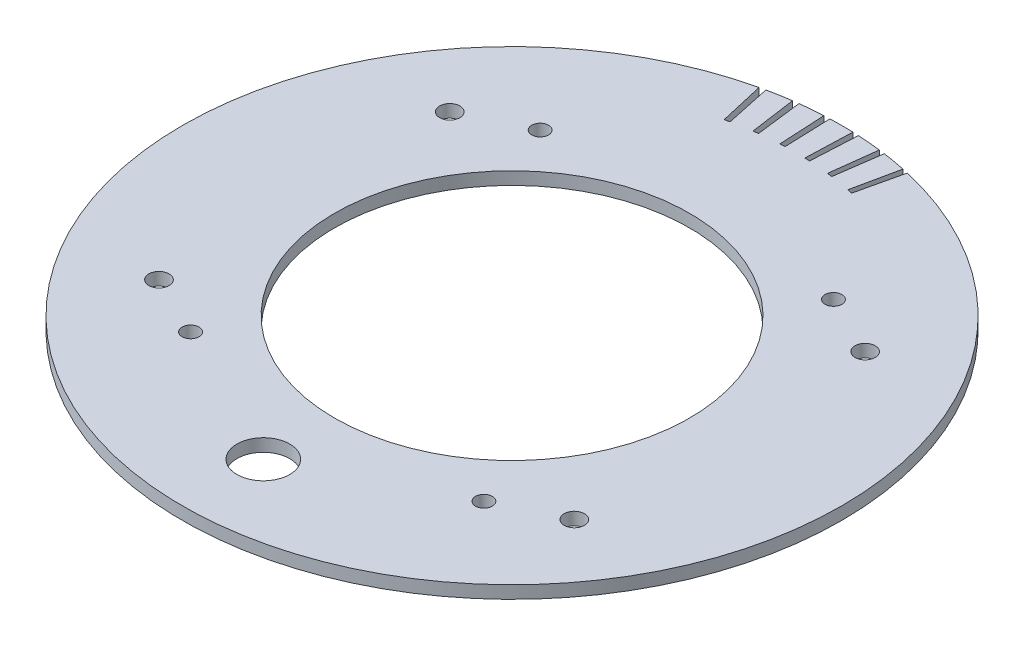
ISO-10303-21;
HEADER;
FILE_DESCRIPTION(('STEP AP214'),'2;1');
FILE_NAME('part.step','',(''),(''),'','','');
FILE_SCHEMA(('AUTOMOTIVE_DESIGN { 1 0 10303 214 1 1 1 1 }'));
ENDSEC;
DATA;
#1=APPLICATION_CONTEXT('core data for automotive mechanical design processes');
#2=APPLICATION_PROTOCOL_DEFINITION('international standard','automotive_design',2000,#1);
#3=PRODUCT_CONTEXT('',#1,'mechanical');
#4=PRODUCT('Part','Part','',(#3));
#5=PRODUCT_RELATED_PRODUCT_CATEGORY('part','',(#4));
#6=PRODUCT_DEFINITION_FORMATION('','',#4);
#7=PRODUCT_DEFINITION_CONTEXT('part definition',#1,'design');
#8=PRODUCT_DEFINITION('design','',#6,#7);
#9=PRODUCT_DEFINITION_SHAPE('','',#8);
#10=(LENGTH_UNIT() NAMED_UNIT(*) SI_UNIT(.MILLI.,.METRE.));
#11=(NAMED_UNIT(*) PLANE_ANGLE_UNIT() SI_UNIT($,.RADIAN.));
#12=(NAMED_UNIT(*) SI_UNIT($,.STERADIAN.) SOLID_ANGLE_UNIT());
#13=UNCERTAINTY_MEASURE_WITH_UNIT(LENGTH_MEASURE(1.E-05),#10,'distance_accuracy_value','');
#14=(GEOMETRIC_REPRESENTATION_CONTEXT(3) GLOBAL_UNCERTAINTY_ASSIGNED_CONTEXT((#13)) GLOBAL_UNIT_ASSIGNED_CONTEXT((#10,
#11,#12)) REPRESENTATION_CONTEXT('',''));
#15=CARTESIAN_POINT('',(0.,0.,0.));
#16=DIRECTION('',(0.,0.,1.));
#17=DIRECTION('',(1.,0.,0.));
#18=AXIS2_PLACEMENT_3D('',#15,#16,#17);
#19=CARTESIAN_POINT('',(0.,-1.905,0.));
#20=DIRECTION('',(0.,1.,0.));
#21=DIRECTION('',(0.,0.,1.));
#22=AXIS2_PLACEMENT_3D('',#19,#20,#21);
#23=CYLINDRICAL_SURFACE('',#22,99.06);
#24=CARTESIAN_POINT('',(0.,1.905,0.));
#25=DIRECTION('',(0.,1.,0.));
#26=DIRECTION('',(0.,0.,1.));
#27=AXIS2_PLACEMENT_3D('',#24,#25,#26);
#28=CIRCLE('',#27,99.06);
#29=CARTESIAN_POINT('',(-13.7864873811041,1.905,-98.09595488954));
#30=VERTEX_POINT('',#29);
#31=CARTESIAN_POINT('',(-20.5957320924073,1.905,-96.8953013286908));
#32=VERTEX_POINT('',#31);
#33=EDGE_CURVE('E360',#30,#32,#28,.T.);
#34=ORIENTED_EDGE('',*,*,#33,.F.);
#35=DIRECTION('',(0.,1.,0.));
#36=VECTOR('',#35,1.);
#37=CARTESIAN_POINT('',(-13.7864873811041,-1.905,-98.09595488954));
#38=LINE('',#37,#36);
#39=CARTESIAN_POINT('',(-13.7864873811041,-1.905,-98.09595488954));
#40=VERTEX_POINT('',#39);
#41=EDGE_CURVE('E239',#40,#30,#38,.T.);
#42=ORIENTED_EDGE('',*,*,#41,.F.);
#43=CARTESIAN_POINT('',(0.,-1.905,0.));
#44=DIRECTION('',(0.,1.,0.));
#45=DIRECTION('',(0.,0.,1.));
#46=AXIS2_PLACEMENT_3D('',#43,#44,#45);
#47=CIRCLE('',#46,99.06);
#48=CARTESIAN_POINT('',(-20.5957320924073,-1.905,-96.8953013286908));
#49=VERTEX_POINT('',#48);
#50=EDGE_CURVE('E374',#40,#49,#47,.T.);
#51=ORIENTED_EDGE('',*,*,#50,.T.);
#52=DIRECTION('',(0.,1.,0.));
#53=VECTOR('',#52,1.);
#54=CARTESIAN_POINT('',(-20.5957320924073,-1.905,-96.8953013286908));
#55=LINE('',#54,#53);
#56=EDGE_CURVE('E363',#49,#32,#55,.T.);
#57=ORIENTED_EDGE('',*,*,#56,.T.);
#58=EDGE_LOOP('',(#34,#42,#51,#57));
#59=FACE_BOUND('',#58,.T.);
#60=ADVANCED_FACE('F41',(#59),#23,.T.);
#61=DIRECTION('',(0.,1.,0.));
#62=VECTOR('',#61,1.);
#63=CARTESIAN_POINT('',(-12.0723771577139,-1.905,-98.3216217815893));
#64=LINE('',#63,#62);
#65=CARTESIAN_POINT('',(-12.0723771577139,-1.905,-98.3216217815893));
#66=VERTEX_POINT('',#65);
#67=CARTESIAN_POINT('',(-12.0723771577139,1.905,-98.3216217815893));
#68=VERTEX_POINT('',#67);
#69=EDGE_CURVE('E209',#66,#68,#64,.T.);
#70=ORIENTED_EDGE('',*,*,#69,.T.);
#71=CARTESIAN_POINT('',(-5.18439982542604,1.905,-98.9242417127881));
#72=VERTEX_POINT('',#71);
#73=EDGE_CURVE('E414',#72,#68,#28,.T.);
#74=ORIENTED_EDGE('',*,*,#73,.F.);
#75=DIRECTION('',(0.,1.,0.));
#76=VECTOR('',#75,1.);
#77=CARTESIAN_POINT('',(-5.18439982542604,-1.905,-98.9242417127881));
#78=LINE('',#77,#76);
#79=CARTESIAN_POINT('',(-5.18439982542604,-1.905,-98.9242417127881));
#80=VERTEX_POINT('',#79);
#81=EDGE_CURVE('E258',#80,#72,#78,.T.);
#82=ORIENTED_EDGE('',*,*,#81,.F.);
#83=EDGE_CURVE('E382',#80,#66,#47,.T.);
#84=ORIENTED_EDGE('',*,*,#83,.T.);
#85=EDGE_LOOP('',(#70,#74,#82,#84));
#86=FACE_BOUND('',#85,.T.);
#87=ADVANCED_FACE('F425',(#86),#23,.T.);
#88=DIRECTION('',(0.,1.,0.));
#89=VECTOR('',#88,1.);
#90=CARTESIAN_POINT('',(-3.45714414334976,-1.905,-98.9996553245116));
#91=LINE('',#90,#89);
#92=CARTESIAN_POINT('',(-3.45714414334976,-1.905,-98.9996553245116));
#93=VERTEX_POINT('',#92);
#94=CARTESIAN_POINT('',(-3.45714414334976,1.905,-98.9996553245116));
#95=VERTEX_POINT('',#94);
#96=EDGE_CURVE('E260',#93,#95,#91,.T.);
#97=ORIENTED_EDGE('',*,*,#96,.T.);
#98=CARTESIAN_POINT('',(3.45714414334975,1.905,-98.9996553245116));
#99=VERTEX_POINT('',#98);
#100=EDGE_CURVE('E411',#99,#95,#28,.T.);
#101=ORIENTED_EDGE('',*,*,#100,.F.);
#102=DIRECTION('',(0.,1.,0.));
#103=VECTOR('',#102,1.);
#104=CARTESIAN_POINT('',(3.45714414334975,-1.905,-98.9996553245116));
#105=LINE('',#104,#103);
#106=CARTESIAN_POINT('',(3.45714414334975,-1.905,-98.9996553245116));
#107=VERTEX_POINT('',#106);
#108=EDGE_CURVE('E283',#107,#99,#105,.T.);
#109=ORIENTED_EDGE('',*,*,#108,.F.);
#110=EDGE_CURVE('E386',#107,#93,#47,.T.);
#111=ORIENTED_EDGE('',*,*,#110,.T.);
#112=EDGE_LOOP('',(#97,#101,#109,#111));
#113=FACE_BOUND('',#112,.T.);
#114=ADVANCED_FACE('F429',(#113),#23,.T.);
#115=DIRECTION('',(0.,1.,0.));
#116=VECTOR('',#115,1.);
#117=CARTESIAN_POINT('',(5.18439982542603,-1.905,-98.9242417127881));
#118=LINE('',#117,#116);
#119=CARTESIAN_POINT('',(5.18439982542603,-1.905,-98.9242417127881));
#120=VERTEX_POINT('',#119);
#121=CARTESIAN_POINT('',(5.18439982542603,1.905,-98.9242417127881));
#122=VERTEX_POINT('',#121);
#123=EDGE_CURVE('E285',#120,#122,#118,.T.);
#124=ORIENTED_EDGE('',*,*,#123,.T.);
#125=CARTESIAN_POINT('',(12.0723771577139,1.905,-98.3216217815893));
#126=VERTEX_POINT('',#125);
#127=EDGE_CURVE('E410',#126,#122,#28,.T.);
#128=ORIENTED_EDGE('',*,*,#127,.F.);
#129=DIRECTION('',(0.,1.,0.));
#130=VECTOR('',#129,1.);
#131=CARTESIAN_POINT('',(12.0723771577139,-1.905,-98.3216217815893));
#132=LINE('',#131,#130);
#133=CARTESIAN_POINT('',(12.0723771577139,-1.905,-98.3216217815893));
#134=VERTEX_POINT('',#133);
#135=EDGE_CURVE('E309',#134,#126,#132,.T.);
#136=ORIENTED_EDGE('',*,*,#135,.F.);
#137=EDGE_CURVE('E381',#134,#120,#47,.T.);
#138=ORIENTED_EDGE('',*,*,#137,.T.);
#139=EDGE_LOOP('',(#124,#128,#136,#138));
#140=FACE_BOUND('',#139,.T.);
#141=ADVANCED_FACE('F397',(#140),#23,.T.);
#142=DIRECTION('',(0.,1.,0.));
#143=VECTOR('',#142,1.);
#144=CARTESIAN_POINT('',(13.7864873811041,-1.905,-98.0959548895399));
#145=LINE('',#144,#143);
#146=CARTESIAN_POINT('',(13.7864873811041,-1.905,-98.0959548895399));
#147=VERTEX_POINT('',#146);
#148=CARTESIAN_POINT('',(13.7864873811041,1.905,-98.0959548895399));
#149=VERTEX_POINT('',#148);
#150=EDGE_CURVE('E311',#147,#149,#145,.T.);
#151=ORIENTED_EDGE('',*,*,#150,.T.);
#152=CARTESIAN_POINT('',(20.5957320924073,1.905,-96.8953013286908));
#153=VERTEX_POINT('',#152);
#154=EDGE_CURVE('E372',#153,#149,#28,.T.);
#155=ORIENTED_EDGE('',*,*,#154,.F.);
#156=DIRECTION('',(0.,1.,0.));
#157=VECTOR('',#156,1.);
#158=CARTESIAN_POINT('',(20.5957320924073,-1.905,-96.8953013286908));
#159=LINE('',#158,#157);
#160=CARTESIAN_POINT('',(20.5957320924073,-1.905,-96.8953013286908));
#161=VERTEX_POINT('',#160);
#162=EDGE_CURVE('E334',#161,#153,#159,.T.);
#163=ORIENTED_EDGE('',*,*,#162,.F.);
#164=EDGE_CURVE('E376',#161,#147,#47,.T.);
#165=ORIENTED_EDGE('',*,*,#164,.T.);
#166=EDGE_LOOP('',(#151,#155,#163,#165));
#167=FACE_BOUND('',#166,.T.);
#168=ADVANCED_FACE('F432',(#167),#23,.T.);
#169=CARTESIAN_POINT('',(0.,-1.905,0.));
#170=DIRECTION('',(0.,1.,0.));
#171=DIRECTION('',(0.,0.,1.));
#172=AXIS2_PLACEMENT_3D('',#169,#170,#171);
#173=PLANE('',#172);
#174=CARTESIAN_POINT('',(-44.082374272303,-1.905,52.5353279090994));
#175=DIRECTION('',(0.,-1.,0.));
#176=DIRECTION('',(0.,0.,-1.));
#177=AXIS2_PLACEMENT_3D('',#174,#175,#176);
#178=CIRCLE('',#177,2.54000000000001);
#179=CARTESIAN_POINT('',(-44.082374272303,-1.905,49.9953279090994));
#180=VERTEX_POINT('',#179);
#181=EDGE_CURVE('E734',#180,#180,#178,.T.);
#182=ORIENTED_EDGE('',*,*,#181,.F.);
#183=EDGE_LOOP('',(#182));
#184=FACE_BOUND('',#183,.T.);
#185=CARTESIAN_POINT('',(44.082374272303,-1.905,52.5353279090994));
#186=DIRECTION('',(0.,-1.,0.));
#187=DIRECTION('',(0.,0.,-1.));
#188=AXIS2_PLACEMENT_3D('',#185,#186,#187);
#189=CIRCLE('',#188,2.54000000000001);
#190=CARTESIAN_POINT('',(44.082374272303,-1.905,49.9953279090994));
#191=VERTEX_POINT('',#190);
#192=EDGE_CURVE('E745',#191,#191,#189,.T.);
#193=ORIENTED_EDGE('',*,*,#192,.F.);
#194=EDGE_LOOP('',(#193));
#195=FACE_BOUND('',#194,.T.);
#196=CARTESIAN_POINT('',(62.4193857748213,-1.905,43.7065244499496));
#197=DIRECTION('',(0.,-1.,0.));
#198=DIRECTION('',(0.,0.,-1.));
#199=AXIS2_PLACEMENT_3D('',#196,#197,#198);
#200=CIRCLE('',#199,3.04800000000002);
#201=CARTESIAN_POINT('',(62.4193857748213,-1.905,40.6585244499496));
#202=VERTEX_POINT('',#201);
#203=EDGE_CURVE('E751',#202,#202,#200,.T.);
#204=ORIENTED_EDGE('',*,*,#203,.F.);
#205=EDGE_LOOP('',(#204));
#206=FACE_BOUND('',#205,.T.);
#207=CARTESIAN_POINT('',(62.4193857748213,-1.905,-43.7065244499496));
#208=DIRECTION('',(0.,-1.,0.));
#209=DIRECTION('',(0.,0.,-1.));
#210=AXIS2_PLACEMENT_3D('',#207,#208,#209);
#211=CIRCLE('',#210,3.04800000000002);
#212=CARTESIAN_POINT('',(62.4193857748213,-1.905,-46.7545244499496));
#213=VERTEX_POINT('',#212);
#214=EDGE_CURVE('E757',#213,#213,#211,.T.);
#215=ORIENTED_EDGE('',*,*,#214,.F.);
#216=EDGE_LOOP('',(#215));
#217=FACE_BOUND('',#216,.T.);
#218=CARTESIAN_POINT('',(44.082374272303,-1.905,-52.5353279090994));
#219=DIRECTION('',(0.,-1.,0.));
#220=DIRECTION('',(0.,0.,-1.));
#221=AXIS2_PLACEMENT_3D('',#218,#219,#220);
#222=CIRCLE('',#221,2.54);
#223=CARTESIAN_POINT('',(44.082374272303,-1.905,-55.0753279090994));
#224=VERTEX_POINT('',#223);
#225=EDGE_CURVE('E798',#224,#224,#222,.T.);
#226=ORIENTED_EDGE('',*,*,#225,.F.);
#227=EDGE_LOOP('',(#226));
#228=FACE_BOUND('',#227,.T.);
#229=CARTESIAN_POINT('',(-44.082374272303,-1.905,-52.5353279090994));
#230=DIRECTION('',(0.,-1.,0.));
#231=DIRECTION('',(0.,0.,-1.));
#232=AXIS2_PLACEMENT_3D('',#229,#230,#231);
#233=CIRCLE('',#232,2.54);
#234=CARTESIAN_POINT('',(-44.082374272303,-1.905,-55.0753279090994));
#235=VERTEX_POINT('',#234);
#236=EDGE_CURVE('E795',#235,#235,#233,.T.);
#237=ORIENTED_EDGE('',*,*,#236,.F.);
#238=EDGE_LOOP('',(#237));
#239=FACE_BOUND('',#238,.T.);
#240=CARTESIAN_POINT('',(-62.4193857748213,-1.905,-43.7065244499496));
#241=DIRECTION('',(0.,-1.,0.));
#242=DIRECTION('',(0.,0.,-1.));
#243=AXIS2_PLACEMENT_3D('',#240,#241,#242);
#244=CIRCLE('',#243,3.04800000000002);
#245=CARTESIAN_POINT('',(-62.4193857748213,-1.905,-46.7545244499496));
#246=VERTEX_POINT('',#245);
#247=EDGE_CURVE('E788',#246,#246,#244,.T.);
#248=ORIENTED_EDGE('',*,*,#247,.F.);
#249=EDGE_LOOP('',(#248));
#250=FACE_BOUND('',#249,.T.);
#251=CARTESIAN_POINT('',(0.,-1.905,74.75474));
#252=DIRECTION('',(0.,-1.,0.));
#253=DIRECTION('',(0.,0.,-1.));
#254=AXIS2_PLACEMENT_3D('',#251,#252,#253);
#255=CIRCLE('',#254,7.9375);
#256=CARTESIAN_POINT('',(0.,-1.905,66.81724));
#257=VERTEX_POINT('',#256);
#258=EDGE_CURVE('E789',#257,#257,#255,.T.);
#259=ORIENTED_EDGE('',*,*,#258,.F.);
#260=EDGE_LOOP('',(#259));
#261=FACE_BOUND('',#260,.T.);
#262=CARTESIAN_POINT('',(-62.4193857748213,-1.905,43.7065244499496));
#263=DIRECTION('',(0.,-1.,0.));
#264=DIRECTION('',(0.,0.,-1.));
#265=AXIS2_PLACEMENT_3D('',#262,#263,#264);
#266=CIRCLE('',#265,3.048);
#267=CARTESIAN_POINT('',(-62.4193857748213,-1.905,40.6585244499496));
#268=VERTEX_POINT('',#267);
#269=EDGE_CURVE('E738',#268,#268,#266,.T.);
#270=ORIENTED_EDGE('',*,*,#269,.F.);
#271=EDGE_LOOP('',(#270));
#272=FACE_BOUND('',#271,.T.);
#273=CARTESIAN_POINT('',(0.,-1.905,0.));
#274=DIRECTION('',(0.,1.,0.));
#275=DIRECTION('',(0.,0.,1.));
#276=AXIS2_PLACEMENT_3D('',#273,#274,#275);
#277=CIRCLE('',#276,53.34);
#278=CARTESIAN_POINT('',(0.,-1.905,53.34));
#279=VERTEX_POINT('',#278);
#280=EDGE_CURVE('E11',#279,#279,#277,.T.);
#281=ORIENTED_EDGE('',*,*,#280,.T.);
#282=EDGE_LOOP('',(#281));
#283=FACE_BOUND('',#282,.T.);
#284=DIRECTION('',(-0.139173100960066,0.,-0.99026806874157));
#285=VECTOR('',#284,1.);
#286=CARTESIAN_POINT('',(0.,-1.905,0.));
#287=LINE('',#286,#285);
#288=CARTESIAN_POINT('',(-11.842239160692,-1.905,-84.2619099692202));
#289=VERTEX_POINT('',#288);
#290=EDGE_CURVE('E210',#289,#40,#287,.T.);
#291=ORIENTED_EDGE('',*,*,#290,.F.);
#292=CARTESIAN_POINT('',(0.,-1.905,0.));
#293=DIRECTION('',(0.,1.,0.));
#294=DIRECTION('',(-0.0871557427476584,0.,0.996194698091746));
#295=AXIS2_PLACEMENT_3D('',#292,#293,#294);
#296=CIRCLE('',#295,85.09);
#297=CARTESIAN_POINT('',(-10.369862430344,-1.905,-84.4557520431601));
#298=VERTEX_POINT('',#297);
#299=EDGE_CURVE('E205',#298,#289,#296,.T.);
#300=ORIENTED_EDGE('',*,*,#299,.F.);
#301=DIRECTION('',(-0.121869343405148,0.,-0.992546151641322));
#302=VECTOR('',#301,1.);
#303=CARTESIAN_POINT('',(0.,-1.905,0.));
#304=LINE('',#303,#302);
#305=EDGE_CURVE('E213',#298,#66,#304,.T.);
#306=ORIENTED_EDGE('',*,*,#305,.T.);
#307=ORIENTED_EDGE('',*,*,#83,.F.);
#308=DIRECTION('',(-0.0523359562429441,0.,-0.998629534754574));
#309=VECTOR('',#308,1.);
#310=CARTESIAN_POINT('',(0.,-1.905,0.));
#311=LINE('',#310,#309);
#312=CARTESIAN_POINT('',(-4.45326651671211,-1.905,-84.9733871122667));
#313=VERTEX_POINT('',#312);
#314=EDGE_CURVE('E248',#313,#80,#311,.T.);
#315=ORIENTED_EDGE('',*,*,#314,.F.);
#316=CARTESIAN_POINT('',(0.,-1.905,0.));
#317=DIRECTION('',(0.,1.,0.));
#318=DIRECTION('',(-0.173648177666931,0.,0.984807753012208));
#319=AXIS2_PLACEMENT_3D('',#316,#317,#318);
#320=CIRCLE('',#319,85.09);
#321=CARTESIAN_POINT('',(-2.96959817441582,-1.905,-85.0381654710549));
#322=VERTEX_POINT('',#321);
#323=EDGE_CURVE('E242',#322,#313,#320,.T.);
#324=ORIENTED_EDGE('',*,*,#323,.F.);
#325=DIRECTION('',(-0.0348994967025011,0.,-0.999390827019096));
#326=VECTOR('',#325,1.);
#327=CARTESIAN_POINT('',(0.,-1.905,0.));
#328=LINE('',#327,#326);
#329=EDGE_CURVE('E244',#322,#93,#328,.T.);
#330=ORIENTED_EDGE('',*,*,#329,.T.);
#331=ORIENTED_EDGE('',*,*,#110,.F.);
#332=DIRECTION('',(0.034899496702501,0.,-0.999390827019096));
#333=VECTOR('',#332,1.);
#334=CARTESIAN_POINT('',(0.,-1.905,0.));
#335=LINE('',#334,#333);
#336=CARTESIAN_POINT('',(2.96959817441581,-1.905,-85.0381654710549));
#337=VERTEX_POINT('',#336);
#338=EDGE_CURVE('E270',#337,#107,#335,.T.);
#339=ORIENTED_EDGE('',*,*,#338,.F.);
#340=CARTESIAN_POINT('',(0.,-1.905,0.));
#341=DIRECTION('',(0.,1.,0.));
#342=DIRECTION('',(-0.258819045102521,0.,0.965925826289068));
#343=AXIS2_PLACEMENT_3D('',#340,#341,#342);
#344=CIRCLE('',#343,85.09);
#345=CARTESIAN_POINT('',(4.4532665167121,-1.905,-84.9733871122667));
#346=VERTEX_POINT('',#345);
#347=EDGE_CURVE('E264',#346,#337,#344,.T.);
#348=ORIENTED_EDGE('',*,*,#347,.F.);
#349=DIRECTION('',(0.0523359562429439,0.,-0.998629534754574));
#350=VECTOR('',#349,1.);
#351=CARTESIAN_POINT('',(0.,-1.905,0.));
#352=LINE('',#351,#350);
#353=EDGE_CURVE('E266',#346,#120,#352,.T.);
#354=ORIENTED_EDGE('',*,*,#353,.T.);
#355=ORIENTED_EDGE('',*,*,#137,.F.);
#356=DIRECTION('',(0.121869343405148,0.,-0.992546151641322));
#357=VECTOR('',#356,1.);
#358=CARTESIAN_POINT('',(0.,-1.905,0.));
#359=LINE('',#358,#357);
#360=CARTESIAN_POINT('',(10.369862430344,-1.905,-84.4557520431601));
#361=VERTEX_POINT('',#360);
#362=EDGE_CURVE('E296',#361,#134,#359,.T.);
#363=ORIENTED_EDGE('',*,*,#362,.F.);
#364=CARTESIAN_POINT('',(0.,-1.905,0.));
#365=DIRECTION('',(0.,1.,0.));
#366=DIRECTION('',(-0.342020143325669,0.,0.939692620785908));
#367=AXIS2_PLACEMENT_3D('',#364,#365,#366);
#368=CIRCLE('',#367,85.09);
#369=CARTESIAN_POINT('',(11.842239160692,-1.905,-84.2619099692202));
#370=VERTEX_POINT('',#369);
#371=EDGE_CURVE('E290',#370,#361,#368,.T.);
#372=ORIENTED_EDGE('',*,*,#371,.F.);
#373=DIRECTION('',(0.139173100960066,0.,-0.99026806874157));
#374=VECTOR('',#373,1.);
#375=CARTESIAN_POINT('',(0.,-1.905,0.));
#376=LINE('',#375,#374);
#377=EDGE_CURVE('E292',#370,#147,#376,.T.);
#378=ORIENTED_EDGE('',*,*,#377,.T.);
#379=ORIENTED_EDGE('',*,*,#164,.F.);
#380=DIRECTION('',(0.20791169081776,0.,-0.978147600733806));
#381=VECTOR('',#380,1.);
#382=CARTESIAN_POINT('',(0.,-1.905,0.));
#383=LINE('',#382,#381);
#384=CARTESIAN_POINT('',(17.6912057716832,-1.905,-83.2305793464395));
#385=VERTEX_POINT('',#384);
#386=EDGE_CURVE('E322',#385,#161,#383,.T.);
#387=ORIENTED_EDGE('',*,*,#386,.F.);
#388=CARTESIAN_POINT('',(0.,-1.905,0.));
#389=DIRECTION('',(0.,1.,0.));
#390=DIRECTION('',(-0.4226182617407,0.,0.90630778703665));
#391=AXIS2_PLACEMENT_3D('',#388,#389,#390);
#392=CIRCLE('',#391,85.09);
#393=CARTESIAN_POINT('',(19.1410852141195,-1.905,-82.9091488125757));
#394=VERTEX_POINT('',#393);
#395=EDGE_CURVE('E316',#394,#385,#392,.T.);
#396=ORIENTED_EDGE('',*,*,#395,.F.);
#397=DIRECTION('',(0.224951054343865,0.,-0.974370064785235));
#398=VECTOR('',#397,1.);
#399=CARTESIAN_POINT('',(0.,-1.905,0.));
#400=LINE('',#399,#398);
#401=CARTESIAN_POINT('',(22.2836514433033,-1.905,-96.5210986176254));
#402=VERTEX_POINT('',#401);
#403=EDGE_CURVE('E318',#394,#402,#400,.T.);
#404=ORIENTED_EDGE('',*,*,#403,.T.);
#405=CARTESIAN_POINT('',(-22.2836514433033,-1.905,-96.5210986176254));
#406=VERTEX_POINT('',#405);
#407=EDGE_CURVE('E49',#406,#402,#47,.T.);
#408=ORIENTED_EDGE('',*,*,#407,.F.);
#409=DIRECTION('',(-0.224951054343866,0.,-0.974370064785235));
#410=VECTOR('',#409,1.);
#411=CARTESIAN_POINT('',(0.,-1.905,0.));
#412=LINE('',#411,#410);
#413=CARTESIAN_POINT('',(-19.1410852141195,-1.905,-82.9091488125757));
#414=VERTEX_POINT('',#413);
#415=EDGE_CURVE('E347',#414,#406,#412,.T.);
#416=ORIENTED_EDGE('',*,*,#415,.F.);
#417=CARTESIAN_POINT('',(0.,-1.905,0.));
#418=DIRECTION('',(0.,1.,0.));
#419=DIRECTION('',(0.,0.,1.));
#420=AXIS2_PLACEMENT_3D('',#417,#418,#419);
#421=CIRCLE('',#420,85.09);
#422=CARTESIAN_POINT('',(-17.6912057716832,-1.905,-83.2305793464395));
#423=VERTEX_POINT('',#422);
#424=EDGE_CURVE('E341',#423,#414,#421,.T.);
#425=ORIENTED_EDGE('',*,*,#424,.F.);
#426=DIRECTION('',(-0.20791169081776,0.,-0.978147600733805));
#427=VECTOR('',#426,1.);
#428=CARTESIAN_POINT('',(0.,-1.905,0.));
#429=LINE('',#428,#427);
#430=EDGE_CURVE('E343',#423,#49,#429,.T.);
#431=ORIENTED_EDGE('',*,*,#430,.T.);
#432=ORIENTED_EDGE('',*,*,#50,.F.);
#433=EDGE_LOOP('',(#291,#300,#306,#307,#315,#324,#330,#331,#339,#348,#354,#355,#363,#372,#378,
#379,#387,#396,#404,#408,#416,#425,#431,#432));
#434=FACE_BOUND('',#433,.T.);
#435=ADVANCED_FACE('F221',(#184,#195,#206,#217,#228,#239,#250,#261,#272,#283,#434),#173,.F.);
#436=CARTESIAN_POINT('',(0.,1.905,0.));
#437=DIRECTION('',(0.,1.,0.));
#438=DIRECTION('',(0.,0.,1.));
#439=AXIS2_PLACEMENT_3D('',#436,#437,#438);
#440=PLANE('',#439);
#441=CARTESIAN_POINT('',(-44.082374272303,1.905,52.5353279090994));
#442=DIRECTION('',(0.,1.,0.));
#443=DIRECTION('',(0.,0.,1.));
#444=AXIS2_PLACEMENT_3D('',#441,#442,#443);
#445=CIRCLE('',#444,2.54000000000001);
#446=CARTESIAN_POINT('',(-44.082374272303,1.905,55.0753279090994));
#447=VERTEX_POINT('',#446);
#448=EDGE_CURVE('E737',#447,#447,#445,.F.);
#449=ORIENTED_EDGE('',*,*,#448,.T.);
#450=EDGE_LOOP('',(#449));
#451=FACE_BOUND('',#450,.T.);
#452=CARTESIAN_POINT('',(44.082374272303,1.905,52.5353279090994));
#453=DIRECTION('',(0.,1.,0.));
#454=DIRECTION('',(0.,0.,1.));
#455=AXIS2_PLACEMENT_3D('',#452,#453,#454);
#456=CIRCLE('',#455,2.54000000000001);
#457=CARTESIAN_POINT('',(44.082374272303,1.905,55.0753279090994));
#458=VERTEX_POINT('',#457);
#459=EDGE_CURVE('E741',#458,#458,#456,.F.);
#460=ORIENTED_EDGE('',*,*,#459,.T.);
#461=EDGE_LOOP('',(#460));
#462=FACE_BOUND('',#461,.T.);
#463=CARTESIAN_POINT('',(62.4193857748213,1.905,43.7065244499496));
#464=DIRECTION('',(0.,1.,0.));
#465=DIRECTION('',(0.,0.,1.));
#466=AXIS2_PLACEMENT_3D('',#463,#464,#465);
#467=CIRCLE('',#466,3.04800000000002);
#468=CARTESIAN_POINT('',(62.4193857748213,1.905,46.7545244499496));
#469=VERTEX_POINT('',#468);
#470=EDGE_CURVE('E748',#469,#469,#467,.F.);
#471=ORIENTED_EDGE('',*,*,#470,.T.);
#472=EDGE_LOOP('',(#471));
#473=FACE_BOUND('',#472,.T.);
#474=CARTESIAN_POINT('',(62.4193857748213,1.905,-43.7065244499496));
#475=DIRECTION('',(0.,1.,0.));
#476=DIRECTION('',(0.,0.,1.));
#477=AXIS2_PLACEMENT_3D('',#474,#475,#476);
#478=CIRCLE('',#477,3.04800000000002);
#479=CARTESIAN_POINT('',(62.4193857748213,1.905,-40.6585244499496));
#480=VERTEX_POINT('',#479);
#481=EDGE_CURVE('E754',#480,#480,#478,.F.);
#482=ORIENTED_EDGE('',*,*,#481,.T.);
#483=EDGE_LOOP('',(#482));
#484=FACE_BOUND('',#483,.T.);
#485=CARTESIAN_POINT('',(44.082374272303,1.905,-52.5353279090994));
#486=DIRECTION('',(0.,1.,0.));
#487=DIRECTION('',(0.,0.,1.));
#488=AXIS2_PLACEMENT_3D('',#485,#486,#487);
#489=CIRCLE('',#488,2.54);
#490=CARTESIAN_POINT('',(44.082374272303,1.905,-49.9953279090994));
#491=VERTEX_POINT('',#490);
#492=EDGE_CURVE('E760',#491,#491,#489,.F.);
#493=ORIENTED_EDGE('',*,*,#492,.T.);
#494=EDGE_LOOP('',(#493));
#495=FACE_BOUND('',#494,.T.);
#496=CARTESIAN_POINT('',(-44.082374272303,1.905,-52.5353279090994));
#497=DIRECTION('',(0.,1.,0.));
#498=DIRECTION('',(0.,0.,1.));
#499=AXIS2_PLACEMENT_3D('',#496,#497,#498);
#500=CIRCLE('',#499,2.54);
#501=CARTESIAN_POINT('',(-44.082374272303,1.905,-49.9953279090994));
#502=VERTEX_POINT('',#501);
#503=EDGE_CURVE('E772',#502,#502,#500,.F.);
#504=ORIENTED_EDGE('',*,*,#503,.T.);
#505=EDGE_LOOP('',(#504));
#506=FACE_BOUND('',#505,.T.);
#507=CARTESIAN_POINT('',(-62.4193857748213,1.905,-43.7065244499496));
#508=DIRECTION('',(0.,1.,0.));
#509=DIRECTION('',(0.,0.,1.));
#510=AXIS2_PLACEMENT_3D('',#507,#508,#509);
#511=CIRCLE('',#510,3.04800000000002);
#512=CARTESIAN_POINT('',(-62.4193857748213,1.905,-40.6585244499496));
#513=VERTEX_POINT('',#512);
#514=EDGE_CURVE('E776',#513,#513,#511,.F.);
#515=ORIENTED_EDGE('',*,*,#514,.T.);
#516=EDGE_LOOP('',(#515));
#517=FACE_BOUND('',#516,.T.);
#518=CARTESIAN_POINT('',(0.,1.905,74.75474));
#519=DIRECTION('',(0.,1.,0.));
#520=DIRECTION('',(0.,0.,1.));
#521=AXIS2_PLACEMENT_3D('',#518,#519,#520);
#522=CIRCLE('',#521,7.9375);
#523=CARTESIAN_POINT('',(0.,1.905,82.69224));
#524=VERTEX_POINT('',#523);
#525=EDGE_CURVE('E780',#524,#524,#522,.F.);
#526=ORIENTED_EDGE('',*,*,#525,.T.);
#527=EDGE_LOOP('',(#526));
#528=FACE_BOUND('',#527,.T.);
#529=CARTESIAN_POINT('',(-62.4193857748213,1.905,43.7065244499496));
#530=DIRECTION('',(0.,1.,0.));
#531=DIRECTION('',(0.,0.,1.));
#532=AXIS2_PLACEMENT_3D('',#529,#530,#531);
#533=CIRCLE('',#532,3.048);
#534=CARTESIAN_POINT('',(-62.4193857748213,1.905,46.7545244499496));
#535=VERTEX_POINT('',#534);
#536=EDGE_CURVE('E229',#535,#535,#533,.F.);
#537=ORIENTED_EDGE('',*,*,#536,.T.);
#538=EDGE_LOOP('',(#537));
#539=FACE_BOUND('',#538,.T.);
#540=CARTESIAN_POINT('',(0.,1.905,0.));
#541=DIRECTION('',(0.,1.,0.));
#542=DIRECTION('',(0.,0.,1.));
#543=AXIS2_PLACEMENT_3D('',#540,#541,#542);
#544=CIRCLE('',#543,53.34);
#545=CARTESIAN_POINT('',(0.,1.905,53.34));
#546=VERTEX_POINT('',#545);
#547=EDGE_CURVE('E371',#546,#546,#544,.T.);
#548=ORIENTED_EDGE('',*,*,#547,.F.);
#549=EDGE_LOOP('',(#548));
#550=FACE_BOUND('',#549,.T.);
#551=CARTESIAN_POINT('',(0.,1.905,0.));
#552=DIRECTION('',(0.,1.,0.));
#553=DIRECTION('',(-0.0871557427476584,0.,0.996194698091746));
#554=AXIS2_PLACEMENT_3D('',#551,#552,#553);
#555=CIRCLE('',#554,85.09);
#556=CARTESIAN_POINT('',(-10.369862430344,1.905,-84.4557520431601));
#557=VERTEX_POINT('',#556);
#558=CARTESIAN_POINT('',(-11.842239160692,1.905,-84.2619099692202));
#559=VERTEX_POINT('',#558);
#560=EDGE_CURVE('E56',#557,#559,#555,.T.);
#561=ORIENTED_EDGE('',*,*,#560,.T.);
#562=DIRECTION('',(-0.139173100960066,0.,-0.99026806874157));
#563=VECTOR('',#562,1.);
#564=CARTESIAN_POINT('',(0.,1.905,0.));
#565=LINE('',#564,#563);
#566=EDGE_CURVE('E223',#559,#30,#565,.T.);
#567=ORIENTED_EDGE('',*,*,#566,.T.);
#568=ORIENTED_EDGE('',*,*,#33,.T.);
#569=DIRECTION('',(-0.20791169081776,0.,-0.978147600733805));
#570=VECTOR('',#569,1.);
#571=CARTESIAN_POINT('',(0.,1.905,0.));
#572=LINE('',#571,#570);
#573=CARTESIAN_POINT('',(-17.6912057716832,1.905,-83.2305793464395));
#574=VERTEX_POINT('',#573);
#575=EDGE_CURVE('E352',#574,#32,#572,.T.);
#576=ORIENTED_EDGE('',*,*,#575,.F.);
#577=CARTESIAN_POINT('',(0.,1.905,0.));
#578=DIRECTION('',(0.,1.,0.));
#579=DIRECTION('',(0.,0.,1.));
#580=AXIS2_PLACEMENT_3D('',#577,#578,#579);
#581=CIRCLE('',#580,85.09);
#582=CARTESIAN_POINT('',(-19.1410852141195,1.905,-82.9091488125757));
#583=VERTEX_POINT('',#582);
#584=EDGE_CURVE('E238',#574,#583,#581,.T.);
#585=ORIENTED_EDGE('',*,*,#584,.T.);
#586=DIRECTION('',(-0.224951054343866,0.,-0.974370064785235));
#587=VECTOR('',#586,1.);
#588=CARTESIAN_POINT('',(0.,1.905,0.));
#589=LINE('',#588,#587);
#590=CARTESIAN_POINT('',(-22.2836514433033,1.905,-96.5210986176254));
#591=VERTEX_POINT('',#590);
#592=EDGE_CURVE('E344',#583,#591,#589,.T.);
#593=ORIENTED_EDGE('',*,*,#592,.T.);
#594=CARTESIAN_POINT('',(22.2836514433033,1.905,-96.5210986176254));
#595=VERTEX_POINT('',#594);
#596=EDGE_CURVE('E368',#591,#595,#28,.T.);
#597=ORIENTED_EDGE('',*,*,#596,.T.);
#598=DIRECTION('',(0.224951054343865,0.,-0.974370064785235));
#599=VECTOR('',#598,1.);
#600=CARTESIAN_POINT('',(0.,1.905,0.));
#601=LINE('',#600,#599);
#602=CARTESIAN_POINT('',(19.1410852141195,1.905,-82.9091488125757));
#603=VERTEX_POINT('',#602);
#604=EDGE_CURVE('E328',#603,#595,#601,.T.);
#605=ORIENTED_EDGE('',*,*,#604,.F.);
#606=CARTESIAN_POINT('',(0.,1.905,0.));
#607=DIRECTION('',(0.,1.,0.));
#608=DIRECTION('',(-0.4226182617407,0.,0.90630778703665));
#609=AXIS2_PLACEMENT_3D('',#606,#607,#608);
#610=CIRCLE('',#609,85.09);
#611=CARTESIAN_POINT('',(17.6912057716832,1.905,-83.2305793464395));
#612=VERTEX_POINT('',#611);
#613=EDGE_CURVE('E325',#603,#612,#610,.T.);
#614=ORIENTED_EDGE('',*,*,#613,.T.);
#615=DIRECTION('',(0.20791169081776,0.,-0.978147600733806));
#616=VECTOR('',#615,1.);
#617=CARTESIAN_POINT('',(0.,1.905,0.));
#618=LINE('',#617,#616);
#619=EDGE_CURVE('E319',#612,#153,#618,.T.);
#620=ORIENTED_EDGE('',*,*,#619,.T.);
#621=ORIENTED_EDGE('',*,*,#154,.T.);
#622=DIRECTION('',(0.139173100960066,0.,-0.99026806874157));
#623=VECTOR('',#622,1.);
#624=CARTESIAN_POINT('',(0.,1.905,0.));
#625=LINE('',#624,#623);
#626=CARTESIAN_POINT('',(11.842239160692,1.905,-84.2619099692202));
#627=VERTEX_POINT('',#626);
#628=EDGE_CURVE('E302',#627,#149,#625,.T.);
#629=ORIENTED_EDGE('',*,*,#628,.F.);
#630=CARTESIAN_POINT('',(0.,1.905,0.));
#631=DIRECTION('',(0.,1.,0.));
#632=DIRECTION('',(-0.342020143325669,0.,0.939692620785908));
#633=AXIS2_PLACEMENT_3D('',#630,#631,#632);
#634=CIRCLE('',#633,85.09);
#635=CARTESIAN_POINT('',(10.369862430344,1.905,-84.4557520431601));
#636=VERTEX_POINT('',#635);
#637=EDGE_CURVE('E299',#627,#636,#634,.T.);
#638=ORIENTED_EDGE('',*,*,#637,.T.);
#639=DIRECTION('',(0.121869343405148,0.,-0.992546151641322));
#640=VECTOR('',#639,1.);
#641=CARTESIAN_POINT('',(0.,1.905,0.));
#642=LINE('',#641,#640);
#643=EDGE_CURVE('E293',#636,#126,#642,.T.);
#644=ORIENTED_EDGE('',*,*,#643,.T.);
#645=ORIENTED_EDGE('',*,*,#127,.T.);
#646=DIRECTION('',(0.0523359562429439,0.,-0.998629534754574));
#647=VECTOR('',#646,1.);
#648=CARTESIAN_POINT('',(0.,1.905,0.));
#649=LINE('',#648,#647);
#650=CARTESIAN_POINT('',(4.4532665167121,1.905,-84.9733871122667));
#651=VERTEX_POINT('',#650);
#652=EDGE_CURVE('E276',#651,#122,#649,.T.);
#653=ORIENTED_EDGE('',*,*,#652,.F.);
#654=CARTESIAN_POINT('',(0.,1.905,0.));
#655=DIRECTION('',(0.,1.,0.));
#656=DIRECTION('',(-0.258819045102521,0.,0.965925826289068));
#657=AXIS2_PLACEMENT_3D('',#654,#655,#656);
#658=CIRCLE('',#657,85.09);
#659=CARTESIAN_POINT('',(2.96959817441581,1.905,-85.0381654710549));
#660=VERTEX_POINT('',#659);
#661=EDGE_CURVE('E273',#651,#660,#658,.T.);
#662=ORIENTED_EDGE('',*,*,#661,.T.);
#663=DIRECTION('',(0.034899496702501,0.,-0.999390827019096));
#664=VECTOR('',#663,1.);
#665=CARTESIAN_POINT('',(0.,1.905,0.));
#666=LINE('',#665,#664);
#667=EDGE_CURVE('E267',#660,#99,#666,.T.);
#668=ORIENTED_EDGE('',*,*,#667,.T.);
#669=ORIENTED_EDGE('',*,*,#100,.T.);
#670=DIRECTION('',(-0.0348994967025011,0.,-0.999390827019096));
#671=VECTOR('',#670,1.);
#672=CARTESIAN_POINT('',(0.,1.905,0.));
#673=LINE('',#672,#671);
#674=CARTESIAN_POINT('',(-2.96959817441582,1.905,-85.0381654710549));
#675=VERTEX_POINT('',#674);
#676=EDGE_CURVE('E252',#675,#95,#673,.T.);
#677=ORIENTED_EDGE('',*,*,#676,.F.);
#678=CARTESIAN_POINT('',(0.,1.905,0.));
#679=DIRECTION('',(0.,1.,0.));
#680=DIRECTION('',(-0.173648177666931,0.,0.984807753012208));
#681=AXIS2_PLACEMENT_3D('',#678,#679,#680);
#682=CIRCLE('',#681,85.09);
#683=CARTESIAN_POINT('',(-4.45326651671211,1.905,-84.9733871122667));
#684=VERTEX_POINT('',#683);
#685=EDGE_CURVE('E64',#675,#684,#682,.T.);
#686=ORIENTED_EDGE('',*,*,#685,.T.);
#687=DIRECTION('',(-0.0523359562429441,0.,-0.998629534754574));
#688=VECTOR('',#687,1.);
#689=CARTESIAN_POINT('',(0.,1.905,0.));
#690=LINE('',#689,#688);
#691=EDGE_CURVE('E245',#684,#72,#690,.T.);
#692=ORIENTED_EDGE('',*,*,#691,.T.);
#693=ORIENTED_EDGE('',*,*,#73,.T.);
#694=DIRECTION('',(-0.121869343405148,0.,-0.992546151641322));
#695=VECTOR('',#694,1.);
#696=CARTESIAN_POINT('',(0.,1.905,0.));
#697=LINE('',#696,#695);
#698=EDGE_CURVE('E226',#557,#68,#697,.T.);
#699=ORIENTED_EDGE('',*,*,#698,.F.);
#700=EDGE_LOOP('',(#561,#567,#568,#576,#585,#593,#597,#605,#614,#620,#621,#629,#638,#644,#645,
#653,#662,#668,#669,#677,#686,#692,#693,#699));
#701=FACE_BOUND('',#700,.T.);
#702=ADVANCED_FACE('F409',(#451,#462,#473,#484,#495,#506,#517,#528,#539,#550,#701),#440,.T.);
#703=DIRECTION('',(0.,1.,0.));
#704=VECTOR('',#703,1.);
#705=CARTESIAN_POINT('',(22.2836514433033,-1.905,-96.5210986176254));
#706=LINE('',#705,#704);
#707=EDGE_CURVE('E336',#402,#595,#706,.T.);
#708=ORIENTED_EDGE('',*,*,#707,.T.);
#709=ORIENTED_EDGE('',*,*,#596,.F.);
#710=DIRECTION('',(0.,1.,0.));
#711=VECTOR('',#710,1.);
#712=CARTESIAN_POINT('',(-22.2836514433033,-1.905,-96.5210986176254));
#713=LINE('',#712,#711);
#714=EDGE_CURVE('E361',#406,#591,#713,.T.);
#715=ORIENTED_EDGE('',*,*,#714,.F.);
#716=ORIENTED_EDGE('',*,*,#407,.T.);
#717=EDGE_LOOP('',(#708,#709,#715,#716));
#718=FACE_BOUND('',#717,.T.);
#719=ADVANCED_FACE('F43',(#718),#23,.T.);
#720=CARTESIAN_POINT('',(0.,-1.905,0.));
#721=DIRECTION('',(0.,1.,0.));
#722=DIRECTION('',(0.,0.,1.));
#723=AXIS2_PLACEMENT_3D('',#720,#721,#722);
#724=CYLINDRICAL_SURFACE('',#723,53.34);
#725=ORIENTED_EDGE('',*,*,#280,.F.);
#726=EDGE_LOOP('',(#725));
#727=FACE_BOUND('',#726,.T.);
#728=ORIENTED_EDGE('',*,*,#547,.T.);
#729=EDGE_LOOP('',(#728));
#730=FACE_BOUND('',#729,.T.);
#731=ADVANCED_FACE('F431',(#727,#730),#724,.F.);
#732=CARTESIAN_POINT('',(0.,-1.905,0.));
#733=DIRECTION('',(0.,1.,0.));
#734=DIRECTION('',(0.,0.,1.));
#735=AXIS2_PLACEMENT_3D('',#732,#733,#734);
#736=CYLINDRICAL_SURFACE('',#735,85.09);
#737=ORIENTED_EDGE('',*,*,#584,.F.);
#738=DIRECTION('',(0.,1.,0.));
#739=VECTOR('',#738,1.);
#740=CARTESIAN_POINT('',(-17.6912057716832,-1.905,-83.2305793464395));
#741=LINE('',#740,#739);
#742=EDGE_CURVE('E349',#423,#574,#741,.T.);
#743=ORIENTED_EDGE('',*,*,#742,.F.);
#744=ORIENTED_EDGE('',*,*,#424,.T.);
#745=DIRECTION('',(0.,1.,0.));
#746=VECTOR('',#745,1.);
#747=CARTESIAN_POINT('',(-19.1410852141195,-1.905,-82.9091488125757));
#748=LINE('',#747,#746);
#749=EDGE_CURVE('E357',#414,#583,#748,.T.);
#750=ORIENTED_EDGE('',*,*,#749,.T.);
#751=EDGE_LOOP('',(#737,#743,#744,#750));
#752=FACE_BOUND('',#751,.T.);
#753=ADVANCED_FACE('F437',(#752),#736,.T.);
#754=CARTESIAN_POINT('',(0.,-1.905,0.));
#755=DIRECTION('',(0.974370064785235,0.,-0.224951054343866));
#756=DIRECTION('',(-0.224951054343866,0.,-0.974370064785235));
#757=AXIS2_PLACEMENT_3D('',#754,#755,#756);
#758=PLANE('',#757);
#759=ORIENTED_EDGE('',*,*,#592,.F.);
#760=ORIENTED_EDGE('',*,*,#749,.F.);
#761=ORIENTED_EDGE('',*,*,#415,.T.);
#762=ORIENTED_EDGE('',*,*,#714,.T.);
#763=EDGE_LOOP('',(#759,#760,#761,#762));
#764=FACE_BOUND('',#763,.T.);
#765=ADVANCED_FACE('F490',(#764),#758,.T.);
#766=CARTESIAN_POINT('',(0.,-1.905,0.));
#767=DIRECTION('',(0.978147600733805,0.,-0.20791169081776));
#768=DIRECTION('',(-0.20791169081776,0.,-0.978147600733806));
#769=AXIS2_PLACEMENT_3D('',#766,#767,#768);
#770=PLANE('',#769);
#771=ORIENTED_EDGE('',*,*,#575,.T.);
#772=ORIENTED_EDGE('',*,*,#56,.F.);
#773=ORIENTED_EDGE('',*,*,#430,.F.);
#774=ORIENTED_EDGE('',*,*,#742,.T.);
#775=EDGE_LOOP('',(#771,#772,#773,#774));
#776=FACE_BOUND('',#775,.T.);
#777=ADVANCED_FACE('F422',(#776),#770,.F.);
#778=CARTESIAN_POINT('',(0.,-1.905,0.));
#779=DIRECTION('',(0.,1.,0.));
#780=DIRECTION('',(0.,0.,1.));
#781=AXIS2_PLACEMENT_3D('',#778,#779,#780);
#782=CYLINDRICAL_SURFACE('',#781,85.09);
#783=ORIENTED_EDGE('',*,*,#613,.F.);
#784=DIRECTION('',(0.,1.,0.));
#785=VECTOR('',#784,1.);
#786=CARTESIAN_POINT('',(19.1410852141195,-1.905,-82.9091488125757));
#787=LINE('',#786,#785);
#788=EDGE_CURVE('E324',#394,#603,#787,.T.);
#789=ORIENTED_EDGE('',*,*,#788,.F.);
#790=ORIENTED_EDGE('',*,*,#395,.T.);
#791=DIRECTION('',(0.,1.,0.));
#792=VECTOR('',#791,1.);
#793=CARTESIAN_POINT('',(17.6912057716832,-1.905,-83.2305793464395));
#794=LINE('',#793,#792);
#795=EDGE_CURVE('E303',#385,#612,#794,.T.);
#796=ORIENTED_EDGE('',*,*,#795,.T.);
#797=EDGE_LOOP('',(#783,#789,#790,#796));
#798=FACE_BOUND('',#797,.T.);
#799=ADVANCED_FACE('F461',(#798),#782,.T.);
#800=CARTESIAN_POINT('',(0.,-1.905,0.));
#801=DIRECTION('',(0.978147600733806,0.,0.20791169081776));
#802=DIRECTION('',(0.20791169081776,0.,-0.978147600733806));
#803=AXIS2_PLACEMENT_3D('',#800,#801,#802);
#804=PLANE('',#803);
#805=ORIENTED_EDGE('',*,*,#619,.F.);
#806=ORIENTED_EDGE('',*,*,#795,.F.);
#807=ORIENTED_EDGE('',*,*,#386,.T.);
#808=ORIENTED_EDGE('',*,*,#162,.T.);
#809=EDGE_LOOP('',(#805,#806,#807,#808));
#810=FACE_BOUND('',#809,.T.);
#811=ADVANCED_FACE('F458',(#810),#804,.T.);
#812=CARTESIAN_POINT('',(0.,-1.905,0.));
#813=DIRECTION('',(0.974370064785235,0.,0.224951054343865));
#814=DIRECTION('',(0.224951054343865,0.,-0.974370064785235));
#815=AXIS2_PLACEMENT_3D('',#812,#813,#814);
#816=PLANE('',#815);
#817=ORIENTED_EDGE('',*,*,#604,.T.);
#818=ORIENTED_EDGE('',*,*,#707,.F.);
#819=ORIENTED_EDGE('',*,*,#403,.F.);
#820=ORIENTED_EDGE('',*,*,#788,.T.);
#821=EDGE_LOOP('',(#817,#818,#819,#820));
#822=FACE_BOUND('',#821,.T.);
#823=ADVANCED_FACE('F478',(#822),#816,.F.);
#824=CARTESIAN_POINT('',(0.,-1.905,0.));
#825=DIRECTION('',(0.,1.,0.));
#826=DIRECTION('',(0.,0.,1.));
#827=AXIS2_PLACEMENT_3D('',#824,#825,#826);
#828=CYLINDRICAL_SURFACE('',#827,85.09);
#829=ORIENTED_EDGE('',*,*,#637,.F.);
#830=DIRECTION('',(0.,1.,0.));
#831=VECTOR('',#830,1.);
#832=CARTESIAN_POINT('',(11.842239160692,-1.905,-84.2619099692202));
#833=LINE('',#832,#831);
#834=EDGE_CURVE('E298',#370,#627,#833,.T.);
#835=ORIENTED_EDGE('',*,*,#834,.F.);
#836=ORIENTED_EDGE('',*,*,#371,.T.);
#837=DIRECTION('',(0.,1.,0.));
#838=VECTOR('',#837,1.);
#839=CARTESIAN_POINT('',(10.369862430344,-1.905,-84.4557520431601));
#840=LINE('',#839,#838);
#841=EDGE_CURVE('E277',#361,#636,#840,.T.);
#842=ORIENTED_EDGE('',*,*,#841,.T.);
#843=EDGE_LOOP('',(#829,#835,#836,#842));
#844=FACE_BOUND('',#843,.T.);
#845=ADVANCED_FACE('F466',(#844),#828,.T.);
#846=CARTESIAN_POINT('',(0.,-1.905,0.));
#847=DIRECTION('',(0.992546151641322,0.,0.121869343405148));
#848=DIRECTION('',(0.121869343405148,0.,-0.992546151641322));
#849=AXIS2_PLACEMENT_3D('',#846,#847,#848);
#850=PLANE('',#849);
#851=ORIENTED_EDGE('',*,*,#643,.F.);
#852=ORIENTED_EDGE('',*,*,#841,.F.);
#853=ORIENTED_EDGE('',*,*,#362,.T.);
#854=ORIENTED_EDGE('',*,*,#135,.T.);
#855=EDGE_LOOP('',(#851,#852,#853,#854));
#856=FACE_BOUND('',#855,.T.);
#857=ADVANCED_FACE('F469',(#856),#850,.T.);
#858=CARTESIAN_POINT('',(0.,-1.905,0.));
#859=DIRECTION('',(0.99026806874157,0.,0.139173100960066));
#860=DIRECTION('',(0.139173100960066,0.,-0.99026806874157));
#861=AXIS2_PLACEMENT_3D('',#858,#859,#860);
#862=PLANE('',#861);
#863=ORIENTED_EDGE('',*,*,#628,.T.);
#864=ORIENTED_EDGE('',*,*,#150,.F.);
#865=ORIENTED_EDGE('',*,*,#377,.F.);
#866=ORIENTED_EDGE('',*,*,#834,.T.);
#867=EDGE_LOOP('',(#863,#864,#865,#866));
#868=FACE_BOUND('',#867,.T.);
#869=ADVANCED_FACE('F464',(#868),#862,.F.);
#870=CARTESIAN_POINT('',(0.,-1.905,0.));
#871=DIRECTION('',(0.,1.,0.));
#872=DIRECTION('',(0.,0.,1.));
#873=AXIS2_PLACEMENT_3D('',#870,#871,#872);
#874=CYLINDRICAL_SURFACE('',#873,85.09);
#875=ORIENTED_EDGE('',*,*,#661,.F.);
#876=DIRECTION('',(0.,1.,0.));
#877=VECTOR('',#876,1.);
#878=CARTESIAN_POINT('',(4.4532665167121,-1.905,-84.9733871122667));
#879=LINE('',#878,#877);
#880=EDGE_CURVE('E272',#346,#651,#879,.T.);
#881=ORIENTED_EDGE('',*,*,#880,.F.);
#882=ORIENTED_EDGE('',*,*,#347,.T.);
#883=DIRECTION('',(0.,1.,0.));
#884=VECTOR('',#883,1.);
#885=CARTESIAN_POINT('',(2.96959817441581,-1.905,-85.0381654710549));
#886=LINE('',#885,#884);
#887=EDGE_CURVE('E253',#337,#660,#886,.T.);
#888=ORIENTED_EDGE('',*,*,#887,.T.);
#889=EDGE_LOOP('',(#875,#881,#882,#888));
#890=FACE_BOUND('',#889,.T.);
#891=ADVANCED_FACE('F476',(#890),#874,.T.);
#892=CARTESIAN_POINT('',(0.,-1.905,0.));
#893=DIRECTION('',(0.999390827019096,0.,0.034899496702501));
#894=DIRECTION('',(0.034899496702501,0.,-0.999390827019096));
#895=AXIS2_PLACEMENT_3D('',#892,#893,#894);
#896=PLANE('',#895);
#897=ORIENTED_EDGE('',*,*,#667,.F.);
#898=ORIENTED_EDGE('',*,*,#887,.F.);
#899=ORIENTED_EDGE('',*,*,#338,.T.);
#900=ORIENTED_EDGE('',*,*,#108,.T.);
#901=EDGE_LOOP('',(#897,#898,#899,#900));
#902=FACE_BOUND('',#901,.T.);
#903=ADVANCED_FACE('F550',(#902),#896,.T.);
#904=CARTESIAN_POINT('',(0.,-1.905,0.));
#905=DIRECTION('',(0.998629534754574,0.,0.0523359562429439));
#906=DIRECTION('',(0.0523359562429439,0.,-0.998629534754574));
#907=AXIS2_PLACEMENT_3D('',#904,#905,#906);
#908=PLANE('',#907);
#909=ORIENTED_EDGE('',*,*,#652,.T.);
#910=ORIENTED_EDGE('',*,*,#123,.F.);
#911=ORIENTED_EDGE('',*,*,#353,.F.);
#912=ORIENTED_EDGE('',*,*,#880,.T.);
#913=EDGE_LOOP('',(#909,#910,#911,#912));
#914=FACE_BOUND('',#913,.T.);
#915=ADVANCED_FACE('F406',(#914),#908,.F.);
#916=CARTESIAN_POINT('',(0.,-1.905,0.));
#917=DIRECTION('',(0.,1.,0.));
#918=DIRECTION('',(0.,0.,1.));
#919=AXIS2_PLACEMENT_3D('',#916,#917,#918);
#920=CYLINDRICAL_SURFACE('',#919,85.09);
#921=ORIENTED_EDGE('',*,*,#685,.F.);
#922=DIRECTION('',(0.,1.,0.));
#923=VECTOR('',#922,1.);
#924=CARTESIAN_POINT('',(-2.96959817441582,-1.905,-85.0381654710549));
#925=LINE('',#924,#923);
#926=EDGE_CURVE('E250',#322,#675,#925,.T.);
#927=ORIENTED_EDGE('',*,*,#926,.F.);
#928=ORIENTED_EDGE('',*,*,#323,.T.);
#929=DIRECTION('',(0.,1.,0.));
#930=VECTOR('',#929,1.);
#931=CARTESIAN_POINT('',(-4.45326651671211,-1.905,-84.9733871122667));
#932=LINE('',#931,#930);
#933=EDGE_CURVE('E234',#313,#684,#932,.T.);
#934=ORIENTED_EDGE('',*,*,#933,.T.);
#935=EDGE_LOOP('',(#921,#927,#928,#934));
#936=FACE_BOUND('',#935,.T.);
#937=ADVANCED_FACE('F568',(#936),#920,.T.);
#938=CARTESIAN_POINT('',(0.,-1.905,0.));
#939=DIRECTION('',(0.998629534754574,0.,-0.0523359562429441));
#940=DIRECTION('',(-0.0523359562429441,0.,-0.998629534754574));
#941=AXIS2_PLACEMENT_3D('',#938,#939,#940);
#942=PLANE('',#941);
#943=ORIENTED_EDGE('',*,*,#691,.F.);
#944=ORIENTED_EDGE('',*,*,#933,.F.);
#945=ORIENTED_EDGE('',*,*,#314,.T.);
#946=ORIENTED_EDGE('',*,*,#81,.T.);
#947=EDGE_LOOP('',(#943,#944,#945,#946));
#948=FACE_BOUND('',#947,.T.);
#949=ADVANCED_FACE('F576',(#948),#942,.T.);
#950=CARTESIAN_POINT('',(0.,-1.905,0.));
#951=DIRECTION('',(0.999390827019096,0.,-0.0348994967025011));
#952=DIRECTION('',(-0.0348994967025011,0.,-0.999390827019096));
#953=AXIS2_PLACEMENT_3D('',#950,#951,#952);
#954=PLANE('',#953);
#955=ORIENTED_EDGE('',*,*,#676,.T.);
#956=ORIENTED_EDGE('',*,*,#96,.F.);
#957=ORIENTED_EDGE('',*,*,#329,.F.);
#958=ORIENTED_EDGE('',*,*,#926,.T.);
#959=EDGE_LOOP('',(#955,#956,#957,#958));
#960=FACE_BOUND('',#959,.T.);
#961=ADVANCED_FACE('F585',(#960),#954,.F.);
#962=CARTESIAN_POINT('',(0.,-1.905,0.));
#963=DIRECTION('',(0.,1.,0.));
#964=DIRECTION('',(0.,0.,1.));
#965=AXIS2_PLACEMENT_3D('',#962,#963,#964);
#966=CYLINDRICAL_SURFACE('',#965,85.09);
#967=ORIENTED_EDGE('',*,*,#560,.F.);
#968=DIRECTION('',(0.,1.,0.));
#969=VECTOR('',#968,1.);
#970=CARTESIAN_POINT('',(-10.369862430344,-1.905,-84.4557520431601));
#971=LINE('',#970,#969);
#972=EDGE_CURVE('E201',#298,#557,#971,.T.);
#973=ORIENTED_EDGE('',*,*,#972,.F.);
#974=ORIENTED_EDGE('',*,*,#299,.T.);
#975=DIRECTION('',(0.,1.,0.));
#976=VECTOR('',#975,1.);
#977=CARTESIAN_POINT('',(-11.842239160692,-1.905,-84.2619099692202));
#978=LINE('',#977,#976);
#979=EDGE_CURVE('E236',#289,#559,#978,.T.);
#980=ORIENTED_EDGE('',*,*,#979,.T.);
#981=EDGE_LOOP('',(#967,#973,#974,#980));
#982=FACE_BOUND('',#981,.T.);
#983=ADVANCED_FACE('F203',(#982),#966,.T.);
#984=CARTESIAN_POINT('',(0.,-1.905,0.));
#985=DIRECTION('',(0.99026806874157,0.,-0.139173100960066));
#986=DIRECTION('',(-0.139173100960066,0.,-0.99026806874157));
#987=AXIS2_PLACEMENT_3D('',#984,#985,#986);
#988=PLANE('',#987);
#989=ORIENTED_EDGE('',*,*,#566,.F.);
#990=ORIENTED_EDGE('',*,*,#979,.F.);
#991=ORIENTED_EDGE('',*,*,#290,.T.);
#992=ORIENTED_EDGE('',*,*,#41,.T.);
#993=EDGE_LOOP('',(#989,#990,#991,#992));
#994=FACE_BOUND('',#993,.T.);
#995=ADVANCED_FACE('F604',(#994),#988,.T.);
#996=CARTESIAN_POINT('',(0.,-1.905,0.));
#997=DIRECTION('',(0.992546151641322,0.,-0.121869343405148));
#998=DIRECTION('',(-0.121869343405148,0.,-0.992546151641322));
#999=AXIS2_PLACEMENT_3D('',#996,#997,#998);
#1000=PLANE('',#999);
#1001=ORIENTED_EDGE('',*,*,#698,.T.);
#1002=ORIENTED_EDGE('',*,*,#69,.F.);
#1003=ORIENTED_EDGE('',*,*,#305,.F.);
#1004=ORIENTED_EDGE('',*,*,#972,.T.);
#1005=EDGE_LOOP('',(#1001,#1002,#1003,#1004));
#1006=FACE_BOUND('',#1005,.T.);
#1007=ADVANCED_FACE('F214',(#1006),#1000,.F.);
#1008=CARTESIAN_POINT('',(-62.4193857748213,24.3556403026729,43.7065244499496));
#1009=DIRECTION('',(0.,-1.,0.));
#1010=DIRECTION('',(0.,0.,-1.));
#1011=AXIS2_PLACEMENT_3D('',#1008,#1009,#1010);
#1012=CYLINDRICAL_SURFACE('',#1011,3.048);
#1013=ORIENTED_EDGE('',*,*,#269,.T.);
#1014=EDGE_LOOP('',(#1013));
#1015=FACE_BOUND('',#1014,.T.);
#1016=ORIENTED_EDGE('',*,*,#536,.F.);
#1017=EDGE_LOOP('',(#1016));
#1018=FACE_BOUND('',#1017,.T.);
#1019=ADVANCED_FACE('F622',(#1015,#1018),#1012,.F.);
#1020=CARTESIAN_POINT('',(0.,24.3556403026729,74.75474));
#1021=DIRECTION('',(0.,-1.,0.));
#1022=DIRECTION('',(0.,0.,-1.));
#1023=AXIS2_PLACEMENT_3D('',#1020,#1021,#1022);
#1024=CYLINDRICAL_SURFACE('',#1023,7.9375);
#1025=ORIENTED_EDGE('',*,*,#258,.T.);
#1026=EDGE_LOOP('',(#1025));
#1027=FACE_BOUND('',#1026,.T.);
#1028=ORIENTED_EDGE('',*,*,#525,.F.);
#1029=EDGE_LOOP('',(#1028));
#1030=FACE_BOUND('',#1029,.T.);
#1031=ADVANCED_FACE('F647',(#1027,#1030),#1024,.F.);
#1032=CARTESIAN_POINT('',(-62.4193857748213,24.3556403026729,-43.7065244499496));
#1033=DIRECTION('',(0.,-1.,0.));
#1034=DIRECTION('',(0.,0.,-1.));
#1035=AXIS2_PLACEMENT_3D('',#1032,#1033,#1034);
#1036=CYLINDRICAL_SURFACE('',#1035,3.04800000000002);
#1037=ORIENTED_EDGE('',*,*,#247,.T.);
#1038=EDGE_LOOP('',(#1037));
#1039=FACE_BOUND('',#1038,.T.);
#1040=ORIENTED_EDGE('',*,*,#514,.F.);
#1041=EDGE_LOOP('',(#1040));
#1042=FACE_BOUND('',#1041,.T.);
#1043=ADVANCED_FACE('F657',(#1039,#1042),#1036,.F.);
#1044=CARTESIAN_POINT('',(-44.082374272303,24.3556403026729,-52.5353279090994));
#1045=DIRECTION('',(0.,-1.,0.));
#1046=DIRECTION('',(0.,0.,-1.));
#1047=AXIS2_PLACEMENT_3D('',#1044,#1045,#1046);
#1048=CYLINDRICAL_SURFACE('',#1047,2.54);
#1049=ORIENTED_EDGE('',*,*,#236,.T.);
#1050=EDGE_LOOP('',(#1049));
#1051=FACE_BOUND('',#1050,.T.);
#1052=ORIENTED_EDGE('',*,*,#503,.F.);
#1053=EDGE_LOOP('',(#1052));
#1054=FACE_BOUND('',#1053,.T.);
#1055=ADVANCED_FACE('F667',(#1051,#1054),#1048,.F.);
#1056=CARTESIAN_POINT('',(44.082374272303,24.3556403026729,-52.5353279090994));
#1057=DIRECTION('',(0.,-1.,0.));
#1058=DIRECTION('',(0.,0.,-1.));
#1059=AXIS2_PLACEMENT_3D('',#1056,#1057,#1058);
#1060=CYLINDRICAL_SURFACE('',#1059,2.54);
#1061=ORIENTED_EDGE('',*,*,#225,.T.);
#1062=EDGE_LOOP('',(#1061));
#1063=FACE_BOUND('',#1062,.T.);
#1064=ORIENTED_EDGE('',*,*,#492,.F.);
#1065=EDGE_LOOP('',(#1064));
#1066=FACE_BOUND('',#1065,.T.);
#1067=ADVANCED_FACE('F677',(#1063,#1066),#1060,.F.);
#1068=CARTESIAN_POINT('',(62.4193857748213,24.3556403026729,-43.7065244499496));
#1069=DIRECTION('',(0.,-1.,0.));
#1070=DIRECTION('',(0.,0.,-1.));
#1071=AXIS2_PLACEMENT_3D('',#1068,#1069,#1070);
#1072=CYLINDRICAL_SURFACE('',#1071,3.04800000000002);
#1073=ORIENTED_EDGE('',*,*,#214,.T.);
#1074=EDGE_LOOP('',(#1073));
#1075=FACE_BOUND('',#1074,.T.);
#1076=ORIENTED_EDGE('',*,*,#481,.F.);
#1077=EDGE_LOOP('',(#1076));
#1078=FACE_BOUND('',#1077,.T.);
#1079=ADVANCED_FACE('F687',(#1075,#1078),#1072,.F.);
#1080=CARTESIAN_POINT('',(62.4193857748213,24.3556403026729,43.7065244499496));
#1081=DIRECTION('',(0.,-1.,0.));
#1082=DIRECTION('',(0.,0.,-1.));
#1083=AXIS2_PLACEMENT_3D('',#1080,#1081,#1082);
#1084=CYLINDRICAL_SURFACE('',#1083,3.04800000000002);
#1085=ORIENTED_EDGE('',*,*,#203,.T.);
#1086=EDGE_LOOP('',(#1085));
#1087=FACE_BOUND('',#1086,.T.);
#1088=ORIENTED_EDGE('',*,*,#470,.F.);
#1089=EDGE_LOOP('',(#1088));
#1090=FACE_BOUND('',#1089,.T.);
#1091=ADVANCED_FACE('F697',(#1087,#1090),#1084,.F.);
#1092=CARTESIAN_POINT('',(44.082374272303,24.3556403026729,52.5353279090994));
#1093=DIRECTION('',(0.,-1.,0.));
#1094=DIRECTION('',(0.,0.,-1.));
#1095=AXIS2_PLACEMENT_3D('',#1092,#1093,#1094);
#1096=CYLINDRICAL_SURFACE('',#1095,2.54000000000001);
#1097=ORIENTED_EDGE('',*,*,#192,.T.);
#1098=EDGE_LOOP('',(#1097));
#1099=FACE_BOUND('',#1098,.T.);
#1100=ORIENTED_EDGE('',*,*,#459,.F.);
#1101=EDGE_LOOP('',(#1100));
#1102=FACE_BOUND('',#1101,.T.);
#1103=ADVANCED_FACE('F707',(#1099,#1102),#1096,.F.);
#1104=CARTESIAN_POINT('',(-44.082374272303,24.3556403026729,52.5353279090994));
#1105=DIRECTION('',(0.,-1.,0.));
#1106=DIRECTION('',(0.,0.,-1.));
#1107=AXIS2_PLACEMENT_3D('',#1104,#1105,#1106);
#1108=CYLINDRICAL_SURFACE('',#1107,2.54000000000001);
#1109=ORIENTED_EDGE('',*,*,#181,.T.);
#1110=EDGE_LOOP('',(#1109));
#1111=FACE_BOUND('',#1110,.T.);
#1112=ORIENTED_EDGE('',*,*,#448,.F.);
#1113=EDGE_LOOP('',(#1112));
#1114=FACE_BOUND('',#1113,.T.);
#1115=ADVANCED_FACE('F717',(#1111,#1114),#1108,.F.);
#1116=CLOSED_SHELL('',(#60,#87,#114,#141,#168,#435,#702,#719,#731,#753,#765,#777,#799,#811,#823,
#845,#857,#869,#891,#903,#915,#937,#949,#961,#983,#995,#1007,#1019,#1031,#1043,#1055,#1067,
#1079,#1091,#1103,#1115));
#1117=MANIFOLD_SOLID_BREP('B2',#1116);
#1118=ADVANCED_BREP_SHAPE_REPRESENTATION('',(#18,#1117),#14);
#1119=SHAPE_DEFINITION_REPRESENTATION(#9,#1118);
ENDSEC;
END-ISO-10303-21;
